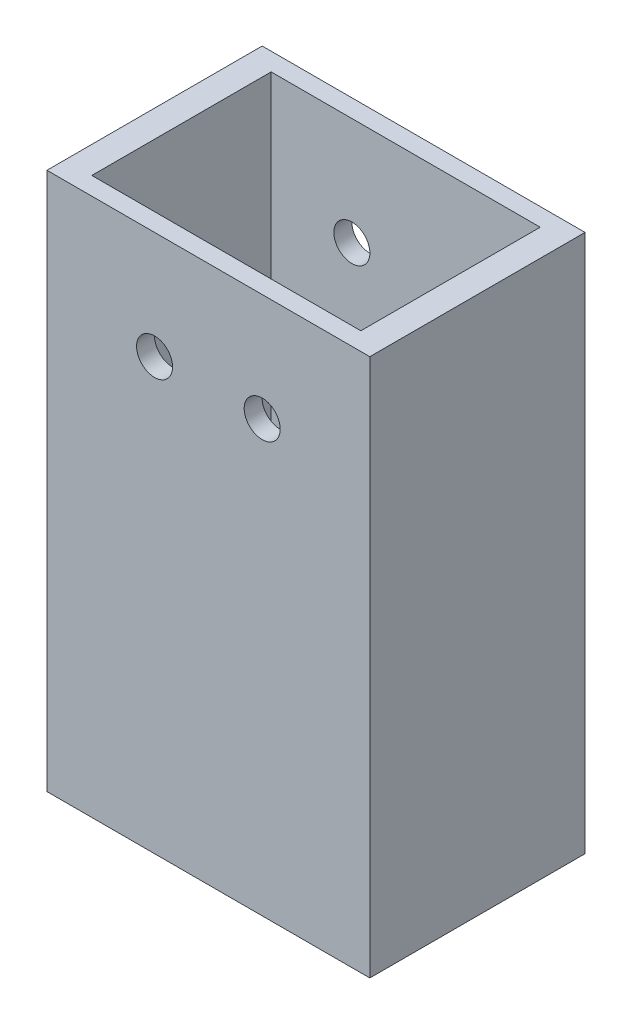
ISO-10303-21;
HEADER;
FILE_DESCRIPTION(('STEP AP214'),'2;1');
FILE_NAME('part.step','',(''),(''),'','','');
FILE_SCHEMA(('AUTOMOTIVE_DESIGN { 1 0 10303 214 1 1 1 1 }'));
ENDSEC;
DATA;
#1=APPLICATION_CONTEXT('core data for automotive mechanical design processes');
#2=APPLICATION_PROTOCOL_DEFINITION('international standard','automotive_design',2000,#1);
#3=PRODUCT_CONTEXT('',#1,'mechanical');
#4=PRODUCT('Part','Part','',(#3));
#5=PRODUCT_RELATED_PRODUCT_CATEGORY('part','',(#4));
#6=PRODUCT_DEFINITION_FORMATION('','',#4);
#7=PRODUCT_DEFINITION_CONTEXT('part definition',#1,'design');
#8=PRODUCT_DEFINITION('design','',#6,#7);
#9=PRODUCT_DEFINITION_SHAPE('','',#8);
#10=(LENGTH_UNIT() NAMED_UNIT(*) SI_UNIT(.MILLI.,.METRE.));
#11=(NAMED_UNIT(*) PLANE_ANGLE_UNIT() SI_UNIT($,.RADIAN.));
#12=(NAMED_UNIT(*) SI_UNIT($,.STERADIAN.) SOLID_ANGLE_UNIT());
#13=UNCERTAINTY_MEASURE_WITH_UNIT(LENGTH_MEASURE(1.E-05),#10,'distance_accuracy_value','');
#14=(GEOMETRIC_REPRESENTATION_CONTEXT(3) GLOBAL_UNCERTAINTY_ASSIGNED_CONTEXT((#13)) GLOBAL_UNIT_ASSIGNED_CONTEXT((#10,
#11,#12)) REPRESENTATION_CONTEXT('',''));
#15=CARTESIAN_POINT('',(0.,0.,0.));
#16=DIRECTION('',(0.,0.,1.));
#17=DIRECTION('',(1.,0.,0.));
#18=AXIS2_PLACEMENT_3D('',#15,#16,#17);
#19=CARTESIAN_POINT('',(0.,63.5,0.));
#20=DIRECTION('',(0.,-1.,0.));
#21=DIRECTION('',(0.,0.,-1.));
#22=AXIS2_PLACEMENT_3D('',#19,#20,#21);
#23=PLANE('',#22);
#24=DIRECTION('',(0.,0.,-1.));
#25=VECTOR('',#24,1.);
#26=CARTESIAN_POINT('',(38.1,63.5,25.4));
#27=LINE('',#26,#25);
#28=CARTESIAN_POINT('',(38.1,63.5,25.4));
#29=VERTEX_POINT('',#28);
#30=CARTESIAN_POINT('',(38.1,63.5,-25.4));
#31=VERTEX_POINT('',#30);
#32=EDGE_CURVE('E139',#29,#31,#27,.T.);
#33=ORIENTED_EDGE('',*,*,#32,.T.);
#34=DIRECTION('',(-1.,0.,0.));
#35=VECTOR('',#34,1.);
#36=CARTESIAN_POINT('',(-38.1,63.5,-25.4));
#37=LINE('',#36,#35);
#38=CARTESIAN_POINT('',(-38.1,63.5,-25.4));
#39=VERTEX_POINT('',#38);
#40=EDGE_CURVE('E142',#31,#39,#37,.T.);
#41=ORIENTED_EDGE('',*,*,#40,.T.);
#42=DIRECTION('',(0.,0.,1.));
#43=VECTOR('',#42,1.);
#44=CARTESIAN_POINT('',(-38.1,63.5,25.4));
#45=LINE('',#44,#43);
#46=CARTESIAN_POINT('',(-38.1,63.5,25.4));
#47=VERTEX_POINT('',#46);
#48=EDGE_CURVE('E145',#39,#47,#45,.T.);
#49=ORIENTED_EDGE('',*,*,#48,.T.);
#50=DIRECTION('',(1.,0.,0.));
#51=VECTOR('',#50,1.);
#52=CARTESIAN_POINT('',(-38.1,63.5,25.4));
#53=LINE('',#52,#51);
#54=EDGE_CURVE('E147',#47,#29,#53,.T.);
#55=ORIENTED_EDGE('',*,*,#54,.T.);
#56=EDGE_LOOP('',(#33,#41,#49,#55));
#57=FACE_BOUND('',#56,.T.);
#58=DIRECTION('',(0.,0.,-1.));
#59=VECTOR('',#58,1.);
#60=CARTESIAN_POINT('',(31.75,63.5,21.1666666666667));
#61=LINE('',#60,#59);
#62=CARTESIAN_POINT('',(31.75,63.5,21.1666666666667));
#63=VERTEX_POINT('',#62);
#64=CARTESIAN_POINT('',(31.75,63.5,-21.1666666666667));
#65=VERTEX_POINT('',#64);
#66=EDGE_CURVE('E101',#63,#65,#61,.T.);
#67=ORIENTED_EDGE('',*,*,#66,.F.);
#68=DIRECTION('',(1.,0.,0.));
#69=VECTOR('',#68,1.);
#70=CARTESIAN_POINT('',(-31.75,63.5,21.1666666666667));
#71=LINE('',#70,#69);
#72=CARTESIAN_POINT('',(-31.75,63.5,21.1666666666667));
#73=VERTEX_POINT('',#72);
#74=EDGE_CURVE('E123',#73,#63,#71,.T.);
#75=ORIENTED_EDGE('',*,*,#74,.F.);
#76=DIRECTION('',(0.,0.,1.));
#77=VECTOR('',#76,1.);
#78=CARTESIAN_POINT('',(-31.75,63.5,21.1666666666667));
#79=LINE('',#78,#77);
#80=CARTESIAN_POINT('',(-31.75,63.5,-21.1666666666667));
#81=VERTEX_POINT('',#80);
#82=EDGE_CURVE('E121',#81,#73,#79,.T.);
#83=ORIENTED_EDGE('',*,*,#82,.F.);
#84=DIRECTION('',(-1.,0.,0.));
#85=VECTOR('',#84,1.);
#86=CARTESIAN_POINT('',(-31.75,63.5,-21.1666666666667));
#87=LINE('',#86,#85);
#88=EDGE_CURVE('E109',#65,#81,#87,.T.);
#89=ORIENTED_EDGE('',*,*,#88,.F.);
#90=EDGE_LOOP('',(#67,#75,#83,#89));
#91=FACE_BOUND('',#90,.T.);
#92=ADVANCED_FACE('F34',(#57,#91),#23,.F.);
#93=CARTESIAN_POINT('',(0.,-63.5,0.));
#94=DIRECTION('',(0.,-1.,0.));
#95=DIRECTION('',(0.,0.,-1.));
#96=AXIS2_PLACEMENT_3D('',#93,#94,#95);
#97=PLANE('',#96);
#98=DIRECTION('',(0.,0.,-1.));
#99=VECTOR('',#98,1.);
#100=CARTESIAN_POINT('',(38.1,-63.5,25.4));
#101=LINE('',#100,#99);
#102=CARTESIAN_POINT('',(38.1,-63.5,25.4));
#103=VERTEX_POINT('',#102);
#104=CARTESIAN_POINT('',(38.1,-63.5,-25.4));
#105=VERTEX_POINT('',#104);
#106=EDGE_CURVE('E117',#103,#105,#101,.T.);
#107=ORIENTED_EDGE('',*,*,#106,.F.);
#108=DIRECTION('',(1.,0.,0.));
#109=VECTOR('',#108,1.);
#110=CARTESIAN_POINT('',(-38.1,-63.5,25.4));
#111=LINE('',#110,#109);
#112=CARTESIAN_POINT('',(-38.1,-63.5,25.4));
#113=VERTEX_POINT('',#112);
#114=EDGE_CURVE('E143',#113,#103,#111,.T.);
#115=ORIENTED_EDGE('',*,*,#114,.F.);
#116=DIRECTION('',(0.,0.,1.));
#117=VECTOR('',#116,1.);
#118=CARTESIAN_POINT('',(-38.1,-63.5,25.4));
#119=LINE('',#118,#117);
#120=CARTESIAN_POINT('',(-38.1,-63.5,-25.4));
#121=VERTEX_POINT('',#120);
#122=EDGE_CURVE('E154',#121,#113,#119,.T.);
#123=ORIENTED_EDGE('',*,*,#122,.F.);
#124=DIRECTION('',(-1.,0.,0.));
#125=VECTOR('',#124,1.);
#126=CARTESIAN_POINT('',(-38.1,-63.5,-25.4));
#127=LINE('',#126,#125);
#128=EDGE_CURVE('E152',#105,#121,#127,.T.);
#129=ORIENTED_EDGE('',*,*,#128,.F.);
#130=EDGE_LOOP('',(#107,#115,#123,#129));
#131=FACE_BOUND('',#130,.T.);
#132=DIRECTION('',(1.,0.,0.));
#133=VECTOR('',#132,1.);
#134=CARTESIAN_POINT('',(-31.75,-63.5,21.1666666666667));
#135=LINE('',#134,#133);
#136=CARTESIAN_POINT('',(-31.75,-63.5,21.1666666666667));
#137=VERTEX_POINT('',#136);
#138=CARTESIAN_POINT('',(31.75,-63.5,21.1666666666667));
#139=VERTEX_POINT('',#138);
#140=EDGE_CURVE('E110',#137,#139,#135,.T.);
#141=ORIENTED_EDGE('',*,*,#140,.T.);
#142=DIRECTION('',(0.,0.,-1.));
#143=VECTOR('',#142,1.);
#144=CARTESIAN_POINT('',(31.75,-63.5,21.1666666666667));
#145=LINE('',#144,#143);
#146=CARTESIAN_POINT('',(31.75,-63.5,-21.1666666666667));
#147=VERTEX_POINT('',#146);
#148=EDGE_CURVE('E59',#139,#147,#145,.T.);
#149=ORIENTED_EDGE('',*,*,#148,.T.);
#150=DIRECTION('',(-1.,0.,0.));
#151=VECTOR('',#150,1.);
#152=CARTESIAN_POINT('',(-31.75,-63.5,-21.1666666666667));
#153=LINE('',#152,#151);
#154=CARTESIAN_POINT('',(-31.75,-63.5,-21.1666666666667));
#155=VERTEX_POINT('',#154);
#156=EDGE_CURVE('E116',#147,#155,#153,.T.);
#157=ORIENTED_EDGE('',*,*,#156,.T.);
#158=DIRECTION('',(0.,0.,1.));
#159=VECTOR('',#158,1.);
#160=CARTESIAN_POINT('',(-31.75,-63.5,21.1666666666667));
#161=LINE('',#160,#159);
#162=EDGE_CURVE('E131',#155,#137,#161,.T.);
#163=ORIENTED_EDGE('',*,*,#162,.T.);
#164=EDGE_LOOP('',(#141,#149,#157,#163));
#165=FACE_BOUND('',#164,.T.);
#166=ADVANCED_FACE('F206',(#131,#165),#97,.T.);
#167=CARTESIAN_POINT('',(38.1,63.5,25.4));
#168=DIRECTION('',(-1.,0.,0.));
#169=DIRECTION('',(0.,0.,1.));
#170=AXIS2_PLACEMENT_3D('',#167,#168,#169);
#171=PLANE('',#170);
#172=ORIENTED_EDGE('',*,*,#106,.T.);
#173=DIRECTION('',(0.,-1.,0.));
#174=VECTOR('',#173,1.);
#175=CARTESIAN_POINT('',(38.1,63.5,-25.4));
#176=LINE('',#175,#174);
#177=EDGE_CURVE('E11',#31,#105,#176,.T.);
#178=ORIENTED_EDGE('',*,*,#177,.F.);
#179=ORIENTED_EDGE('',*,*,#32,.F.);
#180=DIRECTION('',(0.,-1.,0.));
#181=VECTOR('',#180,1.);
#182=CARTESIAN_POINT('',(38.1,63.5,25.4));
#183=LINE('',#182,#181);
#184=EDGE_CURVE('E149',#29,#103,#183,.T.);
#185=ORIENTED_EDGE('',*,*,#184,.T.);
#186=EDGE_LOOP('',(#172,#178,#179,#185));
#187=FACE_BOUND('',#186,.T.);
#188=ADVANCED_FACE('F36',(#187),#171,.F.);
#189=CARTESIAN_POINT('',(-38.1,63.5,-25.4));
#190=DIRECTION('',(0.,0.,1.));
#191=DIRECTION('',(1.,0.,0.));
#192=AXIS2_PLACEMENT_3D('',#189,#190,#191);
#193=PLANE('',#192);
#194=CARTESIAN_POINT('',(-12.7,38.1,-25.4));
#195=DIRECTION('',(0.,0.,1.));
#196=DIRECTION('',(1.,0.,0.));
#197=AXIS2_PLACEMENT_3D('',#194,#195,#196);
#198=CIRCLE('',#197,4.24999999999999);
#199=CARTESIAN_POINT('',(-8.44999999999998,38.1,-25.4));
#200=VERTEX_POINT('',#199);
#201=EDGE_CURVE('E180',#200,#200,#198,.T.);
#202=ORIENTED_EDGE('',*,*,#201,.T.);
#203=EDGE_LOOP('',(#202));
#204=FACE_BOUND('',#203,.T.);
#205=CARTESIAN_POINT('',(12.7,38.1,-25.4));
#206=DIRECTION('',(0.,0.,1.));
#207=DIRECTION('',(1.,0.,0.));
#208=AXIS2_PLACEMENT_3D('',#205,#206,#207);
#209=CIRCLE('',#208,4.24999999999999);
#210=CARTESIAN_POINT('',(16.95,38.1,-25.4));
#211=VERTEX_POINT('',#210);
#212=EDGE_CURVE('E165',#211,#211,#209,.T.);
#213=ORIENTED_EDGE('',*,*,#212,.T.);
#214=EDGE_LOOP('',(#213));
#215=FACE_BOUND('',#214,.T.);
#216=ORIENTED_EDGE('',*,*,#128,.T.);
#217=DIRECTION('',(0.,-1.,0.));
#218=VECTOR('',#217,1.);
#219=CARTESIAN_POINT('',(-38.1,63.5,-25.4));
#220=LINE('',#219,#218);
#221=EDGE_CURVE('E43',#39,#121,#220,.T.);
#222=ORIENTED_EDGE('',*,*,#221,.F.);
#223=ORIENTED_EDGE('',*,*,#40,.F.);
#224=ORIENTED_EDGE('',*,*,#177,.T.);
#225=EDGE_LOOP('',(#216,#222,#223,#224));
#226=FACE_BOUND('',#225,.T.);
#227=ADVANCED_FACE('F210',(#204,#215,#226),#193,.F.);
#228=CARTESIAN_POINT('',(-38.1,63.5,25.4));
#229=DIRECTION('',(1.,0.,0.));
#230=DIRECTION('',(0.,0.,-1.));
#231=AXIS2_PLACEMENT_3D('',#228,#229,#230);
#232=PLANE('',#231);
#233=ORIENTED_EDGE('',*,*,#122,.T.);
#234=DIRECTION('',(0.,-1.,0.));
#235=VECTOR('',#234,1.);
#236=CARTESIAN_POINT('',(-38.1,63.5,25.4));
#237=LINE('',#236,#235);
#238=EDGE_CURVE('E159',#47,#113,#237,.T.);
#239=ORIENTED_EDGE('',*,*,#238,.F.);
#240=ORIENTED_EDGE('',*,*,#48,.F.);
#241=ORIENTED_EDGE('',*,*,#221,.T.);
#242=EDGE_LOOP('',(#233,#239,#240,#241));
#243=FACE_BOUND('',#242,.T.);
#244=ADVANCED_FACE('F192',(#243),#232,.F.);
#245=CARTESIAN_POINT('',(-38.1,63.5,25.4));
#246=DIRECTION('',(0.,0.,-1.));
#247=DIRECTION('',(-1.,0.,0.));
#248=AXIS2_PLACEMENT_3D('',#245,#246,#247);
#249=PLANE('',#248);
#250=CARTESIAN_POINT('',(-12.7,38.1,25.4));
#251=DIRECTION('',(0.,0.,1.));
#252=DIRECTION('',(1.,0.,0.));
#253=AXIS2_PLACEMENT_3D('',#250,#251,#252);
#254=CIRCLE('',#253,4.24999999999999);
#255=CARTESIAN_POINT('',(-8.44999999999998,38.1,25.4));
#256=VERTEX_POINT('',#255);
#257=EDGE_CURVE('E183',#256,#256,#254,.T.);
#258=ORIENTED_EDGE('',*,*,#257,.F.);
#259=EDGE_LOOP('',(#258));
#260=FACE_BOUND('',#259,.T.);
#261=CARTESIAN_POINT('',(12.7,38.1,25.4));
#262=DIRECTION('',(0.,0.,1.));
#263=DIRECTION('',(1.,0.,0.));
#264=AXIS2_PLACEMENT_3D('',#261,#262,#263);
#265=CIRCLE('',#264,4.24999999999999);
#266=CARTESIAN_POINT('',(16.95,38.1,25.4));
#267=VERTEX_POINT('',#266);
#268=EDGE_CURVE('E170',#267,#267,#265,.T.);
#269=ORIENTED_EDGE('',*,*,#268,.F.);
#270=EDGE_LOOP('',(#269));
#271=FACE_BOUND('',#270,.T.);
#272=ORIENTED_EDGE('',*,*,#114,.T.);
#273=ORIENTED_EDGE('',*,*,#184,.F.);
#274=ORIENTED_EDGE('',*,*,#54,.F.);
#275=ORIENTED_EDGE('',*,*,#238,.T.);
#276=EDGE_LOOP('',(#272,#273,#274,#275));
#277=FACE_BOUND('',#276,.T.);
#278=ADVANCED_FACE('F189',(#260,#271,#277),#249,.F.);
#279=CARTESIAN_POINT('',(31.75,63.5,21.1666666666667));
#280=DIRECTION('',(-1.,0.,0.));
#281=DIRECTION('',(0.,0.,1.));
#282=AXIS2_PLACEMENT_3D('',#279,#280,#281);
#283=PLANE('',#282);
#284=ORIENTED_EDGE('',*,*,#148,.F.);
#285=DIRECTION('',(0.,-1.,0.));
#286=VECTOR('',#285,1.);
#287=CARTESIAN_POINT('',(31.75,63.5,21.1666666666667));
#288=LINE('',#287,#286);
#289=EDGE_CURVE('E105',#63,#139,#288,.T.);
#290=ORIENTED_EDGE('',*,*,#289,.F.);
#291=ORIENTED_EDGE('',*,*,#66,.T.);
#292=DIRECTION('',(0.,-1.,0.));
#293=VECTOR('',#292,1.);
#294=CARTESIAN_POINT('',(31.75,63.5,-21.1666666666667));
#295=LINE('',#294,#293);
#296=EDGE_CURVE('E104',#65,#147,#295,.T.);
#297=ORIENTED_EDGE('',*,*,#296,.T.);
#298=EDGE_LOOP('',(#284,#290,#291,#297));
#299=FACE_BOUND('',#298,.T.);
#300=ADVANCED_FACE('F103',(#299),#283,.T.);
#301=CARTESIAN_POINT('',(-31.75,63.5,-21.1666666666667));
#302=DIRECTION('',(0.,0.,1.));
#303=DIRECTION('',(1.,0.,0.));
#304=AXIS2_PLACEMENT_3D('',#301,#302,#303);
#305=PLANE('',#304);
#306=CARTESIAN_POINT('',(-12.7,38.1,-21.1666666666667));
#307=DIRECTION('',(0.,0.,1.));
#308=DIRECTION('',(1.,0.,0.));
#309=AXIS2_PLACEMENT_3D('',#306,#307,#308);
#310=CIRCLE('',#309,4.24999999999999);
#311=CARTESIAN_POINT('',(-8.44999999999998,38.1,-21.1666666666667));
#312=VERTEX_POINT('',#311);
#313=EDGE_CURVE('E175',#312,#312,#310,.T.);
#314=ORIENTED_EDGE('',*,*,#313,.F.);
#315=EDGE_LOOP('',(#314));
#316=FACE_BOUND('',#315,.T.);
#317=CARTESIAN_POINT('',(12.7,38.1,-21.1666666666667));
#318=DIRECTION('',(0.,0.,1.));
#319=DIRECTION('',(1.,0.,0.));
#320=AXIS2_PLACEMENT_3D('',#317,#318,#319);
#321=CIRCLE('',#320,4.24999999999999);
#322=CARTESIAN_POINT('',(16.95,38.1,-21.1666666666667));
#323=VERTEX_POINT('',#322);
#324=EDGE_CURVE('E129',#323,#323,#321,.T.);
#325=ORIENTED_EDGE('',*,*,#324,.F.);
#326=EDGE_LOOP('',(#325));
#327=FACE_BOUND('',#326,.T.);
#328=ORIENTED_EDGE('',*,*,#156,.F.);
#329=ORIENTED_EDGE('',*,*,#296,.F.);
#330=ORIENTED_EDGE('',*,*,#88,.T.);
#331=DIRECTION('',(0.,-1.,0.));
#332=VECTOR('',#331,1.);
#333=CARTESIAN_POINT('',(-31.75,63.5,-21.1666666666667));
#334=LINE('',#333,#332);
#335=EDGE_CURVE('E118',#81,#155,#334,.T.);
#336=ORIENTED_EDGE('',*,*,#335,.T.);
#337=EDGE_LOOP('',(#328,#329,#330,#336));
#338=FACE_BOUND('',#337,.T.);
#339=ADVANCED_FACE('F113',(#316,#327,#338),#305,.T.);
#340=CARTESIAN_POINT('',(-31.75,63.5,21.1666666666667));
#341=DIRECTION('',(1.,0.,0.));
#342=DIRECTION('',(0.,0.,-1.));
#343=AXIS2_PLACEMENT_3D('',#340,#341,#342);
#344=PLANE('',#343);
#345=ORIENTED_EDGE('',*,*,#162,.F.);
#346=ORIENTED_EDGE('',*,*,#335,.F.);
#347=ORIENTED_EDGE('',*,*,#82,.T.);
#348=DIRECTION('',(0.,-1.,0.));
#349=VECTOR('',#348,1.);
#350=CARTESIAN_POINT('',(-31.75,63.5,21.1666666666667));
#351=LINE('',#350,#349);
#352=EDGE_CURVE('E51',#73,#137,#351,.T.);
#353=ORIENTED_EDGE('',*,*,#352,.T.);
#354=EDGE_LOOP('',(#345,#346,#347,#353));
#355=FACE_BOUND('',#354,.T.);
#356=ADVANCED_FACE('F231',(#355),#344,.T.);
#357=CARTESIAN_POINT('',(-31.75,63.5,21.1666666666667));
#358=DIRECTION('',(0.,0.,-1.));
#359=DIRECTION('',(-1.,0.,0.));
#360=AXIS2_PLACEMENT_3D('',#357,#358,#359);
#361=PLANE('',#360);
#362=CARTESIAN_POINT('',(-12.7,38.1,21.1666666666667));
#363=DIRECTION('',(0.,0.,-1.));
#364=DIRECTION('',(-1.,0.,0.));
#365=AXIS2_PLACEMENT_3D('',#362,#363,#364);
#366=CIRCLE('',#365,4.24999999999999);
#367=CARTESIAN_POINT('',(-16.95,38.1,21.1666666666667));
#368=VERTEX_POINT('',#367);
#369=EDGE_CURVE('E38',#368,#368,#366,.T.);
#370=ORIENTED_EDGE('',*,*,#369,.F.);
#371=EDGE_LOOP('',(#370));
#372=FACE_BOUND('',#371,.T.);
#373=CARTESIAN_POINT('',(12.7,38.1,21.1666666666667));
#374=DIRECTION('',(0.,0.,-1.));
#375=DIRECTION('',(-1.,0.,0.));
#376=AXIS2_PLACEMENT_3D('',#373,#374,#375);
#377=CIRCLE('',#376,4.24999999999999);
#378=CARTESIAN_POINT('',(8.45000000000005,38.1,21.1666666666667));
#379=VERTEX_POINT('',#378);
#380=EDGE_CURVE('E163',#379,#379,#377,.T.);
#381=ORIENTED_EDGE('',*,*,#380,.F.);
#382=EDGE_LOOP('',(#381));
#383=FACE_BOUND('',#382,.T.);
#384=ORIENTED_EDGE('',*,*,#140,.F.);
#385=ORIENTED_EDGE('',*,*,#352,.F.);
#386=ORIENTED_EDGE('',*,*,#74,.T.);
#387=ORIENTED_EDGE('',*,*,#289,.T.);
#388=EDGE_LOOP('',(#384,#385,#386,#387));
#389=FACE_BOUND('',#388,.T.);
#390=ADVANCED_FACE('F235',(#372,#383,#389),#361,.T.);
#391=CARTESIAN_POINT('',(12.7,38.1,25.4));
#392=DIRECTION('',(0.,0.,1.));
#393=DIRECTION('',(1.,0.,0.));
#394=AXIS2_PLACEMENT_3D('',#391,#392,#393);
#395=CYLINDRICAL_SURFACE('',#394,4.24999999999999);
#396=ORIENTED_EDGE('',*,*,#380,.T.);
#397=EDGE_LOOP('',(#396));
#398=FACE_BOUND('',#397,.T.);
#399=ORIENTED_EDGE('',*,*,#268,.T.);
#400=EDGE_LOOP('',(#399));
#401=FACE_BOUND('',#400,.T.);
#402=ADVANCED_FACE('F239',(#398,#401),#395,.F.);
#403=ORIENTED_EDGE('',*,*,#324,.T.);
#404=EDGE_LOOP('',(#403));
#405=FACE_BOUND('',#404,.T.);
#406=ORIENTED_EDGE('',*,*,#212,.F.);
#407=EDGE_LOOP('',(#406));
#408=FACE_BOUND('',#407,.T.);
#409=ADVANCED_FACE('F243',(#405,#408),#395,.F.);
#410=CARTESIAN_POINT('',(-12.7,38.1,25.4));
#411=DIRECTION('',(0.,0.,1.));
#412=DIRECTION('',(1.,0.,0.));
#413=AXIS2_PLACEMENT_3D('',#410,#411,#412);
#414=CYLINDRICAL_SURFACE('',#413,4.24999999999999);
#415=ORIENTED_EDGE('',*,*,#369,.T.);
#416=EDGE_LOOP('',(#415));
#417=FACE_BOUND('',#416,.T.);
#418=ORIENTED_EDGE('',*,*,#257,.T.);
#419=EDGE_LOOP('',(#418));
#420=FACE_BOUND('',#419,.T.);
#421=ADVANCED_FACE('F187',(#417,#420),#414,.F.);
#422=ORIENTED_EDGE('',*,*,#313,.T.);
#423=EDGE_LOOP('',(#422));
#424=FACE_BOUND('',#423,.T.);
#425=ORIENTED_EDGE('',*,*,#201,.F.);
#426=EDGE_LOOP('',(#425));
#427=FACE_BOUND('',#426,.T.);
#428=ADVANCED_FACE('F245',(#424,#427),#414,.F.);
#429=CLOSED_SHELL('',(#92,#166,#188,#227,#244,#278,#300,#339,#356,#390,#402,#409,#421,#428));
#430=MANIFOLD_SOLID_BREP('B2',#429);
#431=ADVANCED_BREP_SHAPE_REPRESENTATION('',(#18,#430),#14);
#432=SHAPE_DEFINITION_REPRESENTATION(#9,#431);
ENDSEC;
END-ISO-10303-21;
